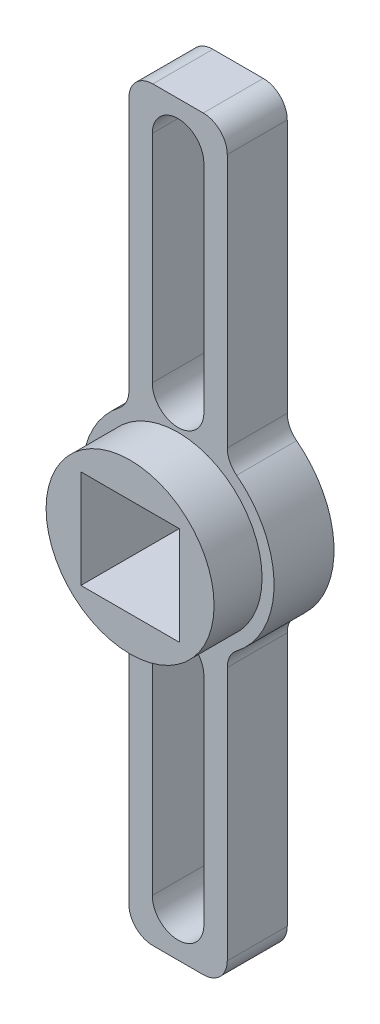
ISO-10303-21;
HEADER;
FILE_DESCRIPTION(('STEP AP214'),'2;1');
FILE_NAME('part.step','',(''),(''),'','','');
FILE_SCHEMA(('AUTOMOTIVE_DESIGN { 1 0 10303 214 1 1 1 1 }'));
ENDSEC;
DATA;
#1=APPLICATION_CONTEXT('core data for automotive mechanical design processes');
#2=APPLICATION_PROTOCOL_DEFINITION('international standard','automotive_design',2000,#1);
#3=PRODUCT_CONTEXT('',#1,'mechanical');
#4=PRODUCT('Part','Part','',(#3));
#5=PRODUCT_RELATED_PRODUCT_CATEGORY('part','',(#4));
#6=PRODUCT_DEFINITION_FORMATION('','',#4);
#7=PRODUCT_DEFINITION_CONTEXT('part definition',#1,'design');
#8=PRODUCT_DEFINITION('design','',#6,#7);
#9=PRODUCT_DEFINITION_SHAPE('','',#8);
#10=(LENGTH_UNIT() NAMED_UNIT(*) SI_UNIT(.MILLI.,.METRE.));
#11=(NAMED_UNIT(*) PLANE_ANGLE_UNIT() SI_UNIT($,.RADIAN.));
#12=(NAMED_UNIT(*) SI_UNIT($,.STERADIAN.) SOLID_ANGLE_UNIT());
#13=UNCERTAINTY_MEASURE_WITH_UNIT(LENGTH_MEASURE(1.E-05),#10,'distance_accuracy_value','');
#14=(GEOMETRIC_REPRESENTATION_CONTEXT(3) GLOBAL_UNCERTAINTY_ASSIGNED_CONTEXT((#13)) GLOBAL_UNIT_ASSIGNED_CONTEXT((#10,
#11,#12)) REPRESENTATION_CONTEXT('',''));
#15=CARTESIAN_POINT('',(0.,0.,0.));
#16=DIRECTION('',(0.,0.,1.));
#17=DIRECTION('',(1.,0.,0.));
#18=AXIS2_PLACEMENT_3D('',#15,#16,#17);
#19=CARTESIAN_POINT('',(0.,0.,5.));
#20=DIRECTION('',(0.,0.,1.));
#21=DIRECTION('',(1.,0.,0.));
#22=AXIS2_PLACEMENT_3D('',#19,#20,#21);
#23=PLANE('',#22);
#24=CARTESIAN_POINT('',(0.,27.5,5.));
#25=DIRECTION('',(0.,0.,1.));
#26=DIRECTION('',(1.,0.,0.));
#27=AXIS2_PLACEMENT_3D('',#24,#25,#26);
#28=CIRCLE('',#27,2.15);
#29=CARTESIAN_POINT('',(2.14999999999999,27.5,5.));
#30=VERTEX_POINT('',#29);
#31=CARTESIAN_POINT('',(-2.15,27.5,5.));
#32=VERTEX_POINT('',#31);
#33=EDGE_CURVE('E278',#30,#32,#28,.T.);
#34=ORIENTED_EDGE('',*,*,#33,.F.);
#35=DIRECTION('',(0.,1.,0.));
#36=VECTOR('',#35,1.);
#37=CARTESIAN_POINT('',(2.14999999999999,27.5,5.));
#38=LINE('',#37,#36);
#39=CARTESIAN_POINT('',(2.15,9.5,5.));
#40=VERTEX_POINT('',#39);
#41=EDGE_CURVE('E289',#40,#30,#38,.T.);
#42=ORIENTED_EDGE('',*,*,#41,.F.);
#43=CARTESIAN_POINT('',(0.,9.5,5.));
#44=DIRECTION('',(0.,0.,1.));
#45=DIRECTION('',(1.,0.,0.));
#46=AXIS2_PLACEMENT_3D('',#43,#44,#45);
#47=CIRCLE('',#46,2.15);
#48=CARTESIAN_POINT('',(-2.15,9.5,5.));
#49=VERTEX_POINT('',#48);
#50=EDGE_CURVE('E308',#49,#40,#47,.T.);
#51=ORIENTED_EDGE('',*,*,#50,.F.);
#52=DIRECTION('',(0.,-1.,0.));
#53=VECTOR('',#52,1.);
#54=CARTESIAN_POINT('',(-2.15,27.5,5.));
#55=LINE('',#54,#53);
#56=EDGE_CURVE('E304',#32,#49,#55,.T.);
#57=ORIENTED_EDGE('',*,*,#56,.F.);
#58=EDGE_LOOP('',(#34,#42,#51,#57));
#59=FACE_BOUND('',#58,.T.);
#60=CARTESIAN_POINT('',(0.,0.,5.));
#61=DIRECTION('',(0.,0.,1.));
#62=DIRECTION('',(1.,0.,0.));
#63=AXIS2_PLACEMENT_3D('',#60,#61,#62);
#64=CIRCLE('',#63,7.);
#65=CARTESIAN_POINT('',(7.,0.,5.));
#66=VERTEX_POINT('',#65);
#67=EDGE_CURVE('E348',#66,#66,#64,.T.);
#68=ORIENTED_EDGE('',*,*,#67,.F.);
#69=EDGE_LOOP('',(#68));
#70=FACE_BOUND('',#69,.T.);
#71=DIRECTION('',(1.,0.,0.));
#72=VECTOR('',#71,1.);
#73=CARTESIAN_POINT('',(-4.09999999999999,-31.1,5.));
#74=LINE('',#73,#72);
#75=CARTESIAN_POINT('',(-2.09999999999999,-31.1,5.));
#76=VERTEX_POINT('',#75);
#77=CARTESIAN_POINT('',(2.10000000000001,-31.1,5.));
#78=VERTEX_POINT('',#77);
#79=EDGE_CURVE('E357',#76,#78,#74,.T.);
#80=ORIENTED_EDGE('',*,*,#79,.T.);
#81=CARTESIAN_POINT('',(2.10000000000001,-29.1,5.));
#82=DIRECTION('',(0.,0.,1.));
#83=DIRECTION('',(1.,0.,0.));
#84=AXIS2_PLACEMENT_3D('',#81,#82,#83);
#85=CIRCLE('',#84,2.);
#86=CARTESIAN_POINT('',(4.10000000000001,-29.1,5.));
#87=VERTEX_POINT('',#86);
#88=EDGE_CURVE('E519',#78,#87,#85,.T.);
#89=ORIENTED_EDGE('',*,*,#88,.T.);
#90=DIRECTION('',(0.,1.,0.));
#91=VECTOR('',#90,1.);
#92=CARTESIAN_POINT('',(4.10000000000001,-31.1,5.));
#93=LINE('',#92,#91);
#94=CARTESIAN_POINT('',(4.1,-7.92401413426301,5.));
#95=VERTEX_POINT('',#94);
#96=EDGE_CURVE('E362',#87,#95,#93,.T.);
#97=ORIENTED_EDGE('',*,*,#96,.T.);
#98=CARTESIAN_POINT('',(6.1,-7.92401413426301,5.));
#99=DIRECTION('',(0.,0.,1.));
#100=DIRECTION('',(1.,0.,0.));
#101=AXIS2_PLACEMENT_3D('',#98,#99,#100);
#102=CIRCLE('',#101,2.);
#103=CARTESIAN_POINT('',(4.88,-6.33921130741041,5.));
#104=VERTEX_POINT('',#103);
#105=EDGE_CURVE('E466',#95,#104,#102,.F.);
#106=ORIENTED_EDGE('',*,*,#105,.T.);
#107=CARTESIAN_POINT('',(0.,0.,5.));
#108=DIRECTION('',(0.,0.,1.));
#109=DIRECTION('',(1.,0.,0.));
#110=AXIS2_PLACEMENT_3D('',#107,#108,#109);
#111=CIRCLE('',#110,8.);
#112=CARTESIAN_POINT('',(4.88,6.33921130741041,5.));
#113=VERTEX_POINT('',#112);
#114=EDGE_CURVE('E426',#104,#113,#111,.T.);
#115=ORIENTED_EDGE('',*,*,#114,.T.);
#116=CARTESIAN_POINT('',(6.1,7.92401413426301,5.));
#117=DIRECTION('',(0.,0.,1.));
#118=DIRECTION('',(1.,0.,0.));
#119=AXIS2_PLACEMENT_3D('',#116,#117,#118);
#120=CIRCLE('',#119,2.);
#121=CARTESIAN_POINT('',(4.1,7.92401413426301,5.));
#122=VERTEX_POINT('',#121);
#123=EDGE_CURVE('E483',#113,#122,#120,.F.);
#124=ORIENTED_EDGE('',*,*,#123,.T.);
#125=DIRECTION('',(0.,-1.,0.));
#126=VECTOR('',#125,1.);
#127=CARTESIAN_POINT('',(4.09999999999999,31.1,5.));
#128=LINE('',#127,#126);
#129=CARTESIAN_POINT('',(4.09999999999999,29.1,5.));
#130=VERTEX_POINT('',#129);
#131=EDGE_CURVE('E385',#130,#122,#128,.T.);
#132=ORIENTED_EDGE('',*,*,#131,.F.);
#133=CARTESIAN_POINT('',(2.09999999999999,29.1,5.));
#134=DIRECTION('',(0.,0.,1.));
#135=DIRECTION('',(1.,0.,0.));
#136=AXIS2_PLACEMENT_3D('',#133,#134,#135);
#137=CIRCLE('',#136,2.);
#138=CARTESIAN_POINT('',(2.09999999999999,31.1,5.));
#139=VERTEX_POINT('',#138);
#140=EDGE_CURVE('E514',#130,#139,#137,.T.);
#141=ORIENTED_EDGE('',*,*,#140,.T.);
#142=DIRECTION('',(-1.,0.,0.));
#143=VECTOR('',#142,1.);
#144=CARTESIAN_POINT('',(4.09999999999999,31.1,5.));
#145=LINE('',#144,#143);
#146=CARTESIAN_POINT('',(-2.1,31.1,5.));
#147=VERTEX_POINT('',#146);
#148=EDGE_CURVE('E377',#139,#147,#145,.T.);
#149=ORIENTED_EDGE('',*,*,#148,.T.);
#150=CARTESIAN_POINT('',(-2.1,29.1,5.));
#151=DIRECTION('',(0.,0.,1.));
#152=DIRECTION('',(1.,0.,0.));
#153=AXIS2_PLACEMENT_3D('',#150,#151,#152);
#154=CIRCLE('',#153,2.);
#155=CARTESIAN_POINT('',(-4.1,29.1,5.));
#156=VERTEX_POINT('',#155);
#157=EDGE_CURVE('E65',#147,#156,#154,.T.);
#158=ORIENTED_EDGE('',*,*,#157,.T.);
#159=DIRECTION('',(0.,-1.,0.));
#160=VECTOR('',#159,1.);
#161=CARTESIAN_POINT('',(-4.1,31.1,5.));
#162=LINE('',#161,#160);
#163=CARTESIAN_POINT('',(-4.1,7.92401413426301,5.));
#164=VERTEX_POINT('',#163);
#165=EDGE_CURVE('E381',#156,#164,#162,.T.);
#166=ORIENTED_EDGE('',*,*,#165,.T.);
#167=CARTESIAN_POINT('',(-6.1,7.92401413426301,5.));
#168=DIRECTION('',(0.,0.,1.));
#169=DIRECTION('',(1.,0.,0.));
#170=AXIS2_PLACEMENT_3D('',#167,#168,#169);
#171=CIRCLE('',#170,2.);
#172=CARTESIAN_POINT('',(-4.88,6.33921130741041,5.));
#173=VERTEX_POINT('',#172);
#174=EDGE_CURVE('E480',#164,#173,#171,.F.);
#175=ORIENTED_EDGE('',*,*,#174,.T.);
#176=CARTESIAN_POINT('',(-4.88,-6.33921130741041,5.));
#177=VERTEX_POINT('',#176);
#178=EDGE_CURVE('E353',#173,#177,#111,.T.);
#179=ORIENTED_EDGE('',*,*,#178,.T.);
#180=CARTESIAN_POINT('',(-6.1,-7.92401413426301,5.));
#181=DIRECTION('',(0.,0.,1.));
#182=DIRECTION('',(1.,0.,0.));
#183=AXIS2_PLACEMENT_3D('',#180,#181,#182);
#184=CIRCLE('',#183,2.);
#185=CARTESIAN_POINT('',(-4.1,-7.92401413426301,5.));
#186=VERTEX_POINT('',#185);
#187=EDGE_CURVE('E469',#177,#186,#184,.F.);
#188=ORIENTED_EDGE('',*,*,#187,.T.);
#189=DIRECTION('',(0.,1.,0.));
#190=VECTOR('',#189,1.);
#191=CARTESIAN_POINT('',(-4.09999999999999,-31.1,5.));
#192=LINE('',#191,#190);
#193=CARTESIAN_POINT('',(-4.09999999999999,-29.1,5.));
#194=VERTEX_POINT('',#193);
#195=EDGE_CURVE('E366',#194,#186,#192,.T.);
#196=ORIENTED_EDGE('',*,*,#195,.F.);
#197=CARTESIAN_POINT('',(-2.09999999999999,-29.1,5.));
#198=DIRECTION('',(0.,0.,1.));
#199=DIRECTION('',(1.,0.,0.));
#200=AXIS2_PLACEMENT_3D('',#197,#198,#199);
#201=CIRCLE('',#200,2.);
#202=EDGE_CURVE('E57',#194,#76,#201,.T.);
#203=ORIENTED_EDGE('',*,*,#202,.T.);
#204=EDGE_LOOP('',(#80,#89,#97,#106,#115,#124,#132,#141,#149,#158,#166,#175,#179,#188,#196,#203));
#205=FACE_BOUND('',#204,.T.);
#206=DIRECTION('',(0.,-1.,0.));
#207=VECTOR('',#206,1.);
#208=CARTESIAN_POINT('',(2.14999999999999,-27.5,5.));
#209=LINE('',#208,#207);
#210=CARTESIAN_POINT('',(2.15,-9.5,5.));
#211=VERTEX_POINT('',#210);
#212=CARTESIAN_POINT('',(2.14999999999999,-27.5,5.));
#213=VERTEX_POINT('',#212);
#214=EDGE_CURVE('E269',#211,#213,#209,.T.);
#215=ORIENTED_EDGE('',*,*,#214,.T.);
#216=CARTESIAN_POINT('',(0.,-27.5,5.));
#217=DIRECTION('',(0.,0.,-1.));
#218=DIRECTION('',(1.,0.,0.));
#219=AXIS2_PLACEMENT_3D('',#216,#217,#218);
#220=CIRCLE('',#219,2.15);
#221=CARTESIAN_POINT('',(-2.15,-27.5,5.));
#222=VERTEX_POINT('',#221);
#223=EDGE_CURVE('E249',#213,#222,#220,.T.);
#224=ORIENTED_EDGE('',*,*,#223,.T.);
#225=DIRECTION('',(0.,1.,0.));
#226=VECTOR('',#225,1.);
#227=CARTESIAN_POINT('',(-2.15,-27.5,5.));
#228=LINE('',#227,#226);
#229=CARTESIAN_POINT('',(-2.15,-9.5,5.));
#230=VERTEX_POINT('',#229);
#231=EDGE_CURVE('E256',#222,#230,#228,.T.);
#232=ORIENTED_EDGE('',*,*,#231,.T.);
#233=CARTESIAN_POINT('',(0.,-9.5,5.));
#234=DIRECTION('',(0.,0.,-1.));
#235=DIRECTION('',(1.,0.,0.));
#236=AXIS2_PLACEMENT_3D('',#233,#234,#235);
#237=CIRCLE('',#236,2.15);
#238=EDGE_CURVE('E260',#230,#211,#237,.T.);
#239=ORIENTED_EDGE('',*,*,#238,.T.);
#240=EDGE_LOOP('',(#215,#224,#232,#239));
#241=FACE_BOUND('',#240,.T.);
#242=ADVANCED_FACE('F41',(#59,#70,#205,#241),#23,.T.);
#243=CARTESIAN_POINT('',(0.,0.,0.));
#244=DIRECTION('',(0.,0.,1.));
#245=DIRECTION('',(1.,0.,0.));
#246=AXIS2_PLACEMENT_3D('',#243,#244,#245);
#247=PLANE('',#246);
#248=DIRECTION('',(0.,1.,0.));
#249=VECTOR('',#248,1.);
#250=CARTESIAN_POINT('',(4.10000000000001,-31.1,0.));
#251=LINE('',#250,#249);
#252=CARTESIAN_POINT('',(4.10000000000001,-29.1,0.));
#253=VERTEX_POINT('',#252);
#254=CARTESIAN_POINT('',(4.1,-7.92401413426301,0.));
#255=VERTEX_POINT('',#254);
#256=EDGE_CURVE('E361',#253,#255,#251,.T.);
#257=ORIENTED_EDGE('',*,*,#256,.F.);
#258=CARTESIAN_POINT('',(2.10000000000001,-29.1,0.));
#259=DIRECTION('',(0.,0.,1.));
#260=DIRECTION('',(1.,0.,0.));
#261=AXIS2_PLACEMENT_3D('',#258,#259,#260);
#262=CIRCLE('',#261,2.);
#263=CARTESIAN_POINT('',(2.10000000000001,-31.1,0.));
#264=VERTEX_POINT('',#263);
#265=EDGE_CURVE('E503',#253,#264,#262,.F.);
#266=ORIENTED_EDGE('',*,*,#265,.T.);
#267=DIRECTION('',(-1.,0.,0.));
#268=VECTOR('',#267,1.);
#269=CARTESIAN_POINT('',(4.10000000000001,-31.1,0.));
#270=LINE('',#269,#268);
#271=CARTESIAN_POINT('',(-2.09999999999999,-31.1,0.));
#272=VERTEX_POINT('',#271);
#273=EDGE_CURVE('E347',#264,#272,#270,.T.);
#274=ORIENTED_EDGE('',*,*,#273,.T.);
#275=CARTESIAN_POINT('',(-2.09999999999999,-29.1,0.));
#276=DIRECTION('',(0.,0.,1.));
#277=DIRECTION('',(1.,0.,0.));
#278=AXIS2_PLACEMENT_3D('',#275,#276,#277);
#279=CIRCLE('',#278,2.);
#280=CARTESIAN_POINT('',(-4.09999999999999,-29.1,0.));
#281=VERTEX_POINT('',#280);
#282=EDGE_CURVE('E500',#272,#281,#279,.F.);
#283=ORIENTED_EDGE('',*,*,#282,.T.);
#284=DIRECTION('',(0.,1.,0.));
#285=VECTOR('',#284,1.);
#286=CARTESIAN_POINT('',(-4.09999999999999,-31.1,0.));
#287=LINE('',#286,#285);
#288=CARTESIAN_POINT('',(-4.1,-7.92401413426301,0.));
#289=VERTEX_POINT('',#288);
#290=EDGE_CURVE('E369',#281,#289,#287,.T.);
#291=ORIENTED_EDGE('',*,*,#290,.T.);
#292=CARTESIAN_POINT('',(-6.1,-7.92401413426301,0.));
#293=DIRECTION('',(0.,0.,1.));
#294=DIRECTION('',(1.,0.,0.));
#295=AXIS2_PLACEMENT_3D('',#292,#293,#294);
#296=CIRCLE('',#295,2.);
#297=CARTESIAN_POINT('',(-4.88,-6.33921130741041,0.));
#298=VERTEX_POINT('',#297);
#299=EDGE_CURVE('E473',#289,#298,#296,.T.);
#300=ORIENTED_EDGE('',*,*,#299,.T.);
#301=CARTESIAN_POINT('',(0.,0.,0.));
#302=DIRECTION('',(0.,0.,1.));
#303=DIRECTION('',(1.,0.,0.));
#304=AXIS2_PLACEMENT_3D('',#301,#302,#303);
#305=CIRCLE('',#304,8.);
#306=CARTESIAN_POINT('',(-4.88,6.33921130741041,0.));
#307=VERTEX_POINT('',#306);
#308=EDGE_CURVE('E427',#307,#298,#305,.T.);
#309=ORIENTED_EDGE('',*,*,#308,.F.);
#310=CARTESIAN_POINT('',(-6.1,7.92401413426301,0.));
#311=DIRECTION('',(0.,0.,1.));
#312=DIRECTION('',(1.,0.,0.));
#313=AXIS2_PLACEMENT_3D('',#310,#311,#312);
#314=CIRCLE('',#313,2.);
#315=CARTESIAN_POINT('',(-4.1,7.92401413426301,0.));
#316=VERTEX_POINT('',#315);
#317=EDGE_CURVE('E476',#307,#316,#314,.T.);
#318=ORIENTED_EDGE('',*,*,#317,.T.);
#319=DIRECTION('',(0.,-1.,0.));
#320=VECTOR('',#319,1.);
#321=CARTESIAN_POINT('',(-4.1,31.1,0.));
#322=LINE('',#321,#320);
#323=CARTESIAN_POINT('',(-4.1,29.1,0.));
#324=VERTEX_POINT('',#323);
#325=EDGE_CURVE('E380',#324,#316,#322,.T.);
#326=ORIENTED_EDGE('',*,*,#325,.F.);
#327=CARTESIAN_POINT('',(-2.1,29.1,0.));
#328=DIRECTION('',(0.,0.,1.));
#329=DIRECTION('',(1.,0.,0.));
#330=AXIS2_PLACEMENT_3D('',#327,#328,#329);
#331=CIRCLE('',#330,2.);
#332=CARTESIAN_POINT('',(-2.1,31.1,0.));
#333=VERTEX_POINT('',#332);
#334=EDGE_CURVE('E494',#324,#333,#331,.F.);
#335=ORIENTED_EDGE('',*,*,#334,.T.);
#336=DIRECTION('',(1.,0.,0.));
#337=VECTOR('',#336,1.);
#338=CARTESIAN_POINT('',(-4.1,31.1,0.));
#339=LINE('',#338,#337);
#340=CARTESIAN_POINT('',(2.09999999999999,31.1,0.));
#341=VERTEX_POINT('',#340);
#342=EDGE_CURVE('E365',#333,#341,#339,.T.);
#343=ORIENTED_EDGE('',*,*,#342,.T.);
#344=CARTESIAN_POINT('',(2.09999999999999,29.1,0.));
#345=DIRECTION('',(0.,0.,1.));
#346=DIRECTION('',(1.,0.,0.));
#347=AXIS2_PLACEMENT_3D('',#344,#345,#346);
#348=CIRCLE('',#347,2.);
#349=CARTESIAN_POINT('',(4.09999999999999,29.1,0.));
#350=VERTEX_POINT('',#349);
#351=EDGE_CURVE('E497',#341,#350,#348,.F.);
#352=ORIENTED_EDGE('',*,*,#351,.T.);
#353=DIRECTION('',(0.,-1.,0.));
#354=VECTOR('',#353,1.);
#355=CARTESIAN_POINT('',(4.09999999999999,31.1,0.));
#356=LINE('',#355,#354);
#357=CARTESIAN_POINT('',(4.1,7.92401413426301,0.));
#358=VERTEX_POINT('',#357);
#359=EDGE_CURVE('E388',#350,#358,#356,.T.);
#360=ORIENTED_EDGE('',*,*,#359,.T.);
#361=CARTESIAN_POINT('',(6.1,7.92401413426301,0.));
#362=DIRECTION('',(0.,0.,1.));
#363=DIRECTION('',(1.,0.,0.));
#364=AXIS2_PLACEMENT_3D('',#361,#362,#363);
#365=CIRCLE('',#364,2.);
#366=CARTESIAN_POINT('',(4.88,6.33921130741041,0.));
#367=VERTEX_POINT('',#366);
#368=EDGE_CURVE('E487',#358,#367,#365,.T.);
#369=ORIENTED_EDGE('',*,*,#368,.T.);
#370=CARTESIAN_POINT('',(4.88,-6.33921130741041,0.));
#371=VERTEX_POINT('',#370);
#372=EDGE_CURVE('E422',#371,#367,#305,.T.);
#373=ORIENTED_EDGE('',*,*,#372,.F.);
#374=CARTESIAN_POINT('',(6.1,-7.92401413426301,0.));
#375=DIRECTION('',(0.,0.,1.));
#376=DIRECTION('',(1.,0.,0.));
#377=AXIS2_PLACEMENT_3D('',#374,#375,#376);
#378=CIRCLE('',#377,2.);
#379=EDGE_CURVE('E462',#371,#255,#378,.T.);
#380=ORIENTED_EDGE('',*,*,#379,.T.);
#381=EDGE_LOOP('',(#257,#266,#274,#283,#291,#300,#309,#318,#326,#335,#343,#352,#360,#369,#373,#380));
#382=FACE_BOUND('',#381,.T.);
#383=DIRECTION('',(1.,0.,0.));
#384=VECTOR('',#383,1.);
#385=CARTESIAN_POINT('',(4.1,-4.1,0.));
#386=LINE('',#385,#384);
#387=CARTESIAN_POINT('',(-4.1,-4.1,0.));
#388=VERTEX_POINT('',#387);
#389=CARTESIAN_POINT('',(4.1,-4.1,0.));
#390=VERTEX_POINT('',#389);
#391=EDGE_CURVE('E396',#388,#390,#386,.T.);
#392=ORIENTED_EDGE('',*,*,#391,.T.);
#393=DIRECTION('',(0.,1.,0.));
#394=VECTOR('',#393,1.);
#395=CARTESIAN_POINT('',(4.1,-4.1,0.));
#396=LINE('',#395,#394);
#397=CARTESIAN_POINT('',(4.1,4.1,0.));
#398=VERTEX_POINT('',#397);
#399=EDGE_CURVE('E400',#390,#398,#396,.T.);
#400=ORIENTED_EDGE('',*,*,#399,.T.);
#401=DIRECTION('',(-1.,0.,0.));
#402=VECTOR('',#401,1.);
#403=CARTESIAN_POINT('',(4.1,4.1,0.));
#404=LINE('',#403,#402);
#405=CARTESIAN_POINT('',(-4.1,4.1,0.));
#406=VERTEX_POINT('',#405);
#407=EDGE_CURVE('E404',#398,#406,#404,.T.);
#408=ORIENTED_EDGE('',*,*,#407,.T.);
#409=DIRECTION('',(0.,-1.,0.));
#410=VECTOR('',#409,1.);
#411=CARTESIAN_POINT('',(-4.1,-4.1,0.));
#412=LINE('',#411,#410);
#413=EDGE_CURVE('E384',#406,#388,#412,.T.);
#414=ORIENTED_EDGE('',*,*,#413,.T.);
#415=EDGE_LOOP('',(#392,#400,#408,#414));
#416=FACE_BOUND('',#415,.T.);
#417=DIRECTION('',(0.,1.,0.));
#418=VECTOR('',#417,1.);
#419=CARTESIAN_POINT('',(2.14999999999999,27.5,0.));
#420=LINE('',#419,#418);
#421=CARTESIAN_POINT('',(2.15,9.5,0.));
#422=VERTEX_POINT('',#421);
#423=CARTESIAN_POINT('',(2.14999999999999,27.5,0.));
#424=VERTEX_POINT('',#423);
#425=EDGE_CURVE('E297',#422,#424,#420,.T.);
#426=ORIENTED_EDGE('',*,*,#425,.T.);
#427=CARTESIAN_POINT('',(0.,27.5,0.));
#428=DIRECTION('',(0.,0.,1.));
#429=DIRECTION('',(1.,0.,0.));
#430=AXIS2_PLACEMENT_3D('',#427,#428,#429);
#431=CIRCLE('',#430,2.15);
#432=CARTESIAN_POINT('',(-2.15,27.5,0.));
#433=VERTEX_POINT('',#432);
#434=EDGE_CURVE('E284',#424,#433,#431,.T.);
#435=ORIENTED_EDGE('',*,*,#434,.T.);
#436=DIRECTION('',(0.,-1.,0.));
#437=VECTOR('',#436,1.);
#438=CARTESIAN_POINT('',(-2.15,27.5,0.));
#439=LINE('',#438,#437);
#440=CARTESIAN_POINT('',(-2.15,9.5,0.));
#441=VERTEX_POINT('',#440);
#442=EDGE_CURVE('E288',#433,#441,#439,.T.);
#443=ORIENTED_EDGE('',*,*,#442,.T.);
#444=CARTESIAN_POINT('',(0.,9.5,0.));
#445=DIRECTION('',(0.,0.,1.));
#446=DIRECTION('',(1.,0.,0.));
#447=AXIS2_PLACEMENT_3D('',#444,#445,#446);
#448=CIRCLE('',#447,2.15);
#449=EDGE_CURVE('E293',#441,#422,#448,.T.);
#450=ORIENTED_EDGE('',*,*,#449,.T.);
#451=EDGE_LOOP('',(#426,#435,#443,#450));
#452=FACE_BOUND('',#451,.T.);
#453=CARTESIAN_POINT('',(0.,-27.5,0.));
#454=DIRECTION('',(0.,0.,-1.));
#455=DIRECTION('',(1.,0.,0.));
#456=AXIS2_PLACEMENT_3D('',#453,#454,#455);
#457=CIRCLE('',#456,2.15);
#458=CARTESIAN_POINT('',(2.14999999999999,-27.5,0.));
#459=VERTEX_POINT('',#458);
#460=CARTESIAN_POINT('',(-2.15,-27.5,0.));
#461=VERTEX_POINT('',#460);
#462=EDGE_CURVE('E242',#459,#461,#457,.T.);
#463=ORIENTED_EDGE('',*,*,#462,.F.);
#464=DIRECTION('',(0.,-1.,0.));
#465=VECTOR('',#464,1.);
#466=CARTESIAN_POINT('',(2.14999999999999,-27.5,0.));
#467=LINE('',#466,#465);
#468=CARTESIAN_POINT('',(2.15,-9.5,0.));
#469=VERTEX_POINT('',#468);
#470=EDGE_CURVE('E229',#469,#459,#467,.T.);
#471=ORIENTED_EDGE('',*,*,#470,.F.);
#472=CARTESIAN_POINT('',(0.,-9.5,0.));
#473=DIRECTION('',(0.,0.,-1.));
#474=DIRECTION('',(1.,0.,0.));
#475=AXIS2_PLACEMENT_3D('',#472,#473,#474);
#476=CIRCLE('',#475,2.15);
#477=CARTESIAN_POINT('',(-2.15,-9.5,0.));
#478=VERTEX_POINT('',#477);
#479=EDGE_CURVE('E241',#478,#469,#476,.T.);
#480=ORIENTED_EDGE('',*,*,#479,.F.);
#481=DIRECTION('',(0.,1.,0.));
#482=VECTOR('',#481,1.);
#483=CARTESIAN_POINT('',(-2.15,-27.5,0.));
#484=LINE('',#483,#482);
#485=EDGE_CURVE('E251',#461,#478,#484,.T.);
#486=ORIENTED_EDGE('',*,*,#485,.F.);
#487=EDGE_LOOP('',(#463,#471,#480,#486));
#488=FACE_BOUND('',#487,.T.);
#489=ADVANCED_FACE('F254',(#382,#416,#452,#488),#247,.F.);
#490=CARTESIAN_POINT('',(0.,0.,5.));
#491=DIRECTION('',(0.,0.,-1.));
#492=DIRECTION('',(-1.,0.,0.));
#493=AXIS2_PLACEMENT_3D('',#490,#491,#492);
#494=CYLINDRICAL_SURFACE('',#493,8.);
#495=ORIENTED_EDGE('',*,*,#114,.F.);
#496=DIRECTION('',(0.,0.,-1.));
#497=VECTOR('',#496,1.);
#498=CARTESIAN_POINT('',(4.88,-6.33921130741041,5.));
#499=LINE('',#498,#497);
#500=EDGE_CURVE('E434',#104,#371,#499,.T.);
#501=ORIENTED_EDGE('',*,*,#500,.T.);
#502=ORIENTED_EDGE('',*,*,#372,.T.);
#503=DIRECTION('',(0.,0.,-1.));
#504=VECTOR('',#503,1.);
#505=CARTESIAN_POINT('',(4.88,6.33921130741041,5.));
#506=LINE('',#505,#504);
#507=EDGE_CURVE('E352',#367,#113,#506,.F.);
#508=ORIENTED_EDGE('',*,*,#507,.T.);
#509=EDGE_LOOP('',(#495,#501,#502,#508));
#510=FACE_BOUND('',#509,.T.);
#511=ADVANCED_FACE('F561',(#510),#494,.T.);
#512=ORIENTED_EDGE('',*,*,#308,.T.);
#513=DIRECTION('',(0.,0.,-1.));
#514=VECTOR('',#513,1.);
#515=CARTESIAN_POINT('',(-4.88,-6.33921130741041,5.));
#516=LINE('',#515,#514);
#517=EDGE_CURVE('E446',#298,#177,#516,.F.);
#518=ORIENTED_EDGE('',*,*,#517,.T.);
#519=ORIENTED_EDGE('',*,*,#178,.F.);
#520=DIRECTION('',(0.,0.,-1.));
#521=VECTOR('',#520,1.);
#522=CARTESIAN_POINT('',(-4.88,6.33921130741041,5.));
#523=LINE('',#522,#521);
#524=EDGE_CURVE('E442',#173,#307,#523,.T.);
#525=ORIENTED_EDGE('',*,*,#524,.T.);
#526=EDGE_LOOP('',(#512,#518,#519,#525));
#527=FACE_BOUND('',#526,.T.);
#528=ADVANCED_FACE('F593',(#527),#494,.T.);
#529=CARTESIAN_POINT('',(-4.1,-4.1,5.));
#530=DIRECTION('',(1.,0.,0.));
#531=DIRECTION('',(0.,0.,-1.));
#532=AXIS2_PLACEMENT_3D('',#529,#530,#531);
#533=PLANE('',#532);
#534=ORIENTED_EDGE('',*,*,#413,.F.);
#535=DIRECTION('',(0.,0.,-1.));
#536=VECTOR('',#535,1.);
#537=CARTESIAN_POINT('',(-4.1,4.1,5.));
#538=LINE('',#537,#536);
#539=CARTESIAN_POINT('',(-4.1,4.1,9.));
#540=VERTEX_POINT('',#539);
#541=EDGE_CURVE('E408',#540,#406,#538,.T.);
#542=ORIENTED_EDGE('',*,*,#541,.F.);
#543=DIRECTION('',(0.,-1.,0.));
#544=VECTOR('',#543,1.);
#545=CARTESIAN_POINT('',(-4.1,4.1,9.));
#546=LINE('',#545,#544);
#547=CARTESIAN_POINT('',(-4.1,-4.1,9.));
#548=VERTEX_POINT('',#547);
#549=EDGE_CURVE('E335',#540,#548,#546,.T.);
#550=ORIENTED_EDGE('',*,*,#549,.T.);
#551=DIRECTION('',(0.,0.,-1.));
#552=VECTOR('',#551,1.);
#553=CARTESIAN_POINT('',(-4.1,-4.1,5.));
#554=LINE('',#553,#552);
#555=EDGE_CURVE('E418',#548,#388,#554,.T.);
#556=ORIENTED_EDGE('',*,*,#555,.T.);
#557=EDGE_LOOP('',(#534,#542,#550,#556));
#558=FACE_BOUND('',#557,.T.);
#559=ADVANCED_FACE('F617',(#558),#533,.T.);
#560=CARTESIAN_POINT('',(4.1,-4.1,5.));
#561=DIRECTION('',(0.,1.,0.));
#562=DIRECTION('',(-1.,0.,0.));
#563=AXIS2_PLACEMENT_3D('',#560,#561,#562);
#564=PLANE('',#563);
#565=ORIENTED_EDGE('',*,*,#391,.F.);
#566=ORIENTED_EDGE('',*,*,#555,.F.);
#567=DIRECTION('',(1.,0.,0.));
#568=VECTOR('',#567,1.);
#569=CARTESIAN_POINT('',(-4.1,-4.1,9.));
#570=LINE('',#569,#568);
#571=CARTESIAN_POINT('',(4.1,-4.1,9.));
#572=VERTEX_POINT('',#571);
#573=EDGE_CURVE('E339',#548,#572,#570,.T.);
#574=ORIENTED_EDGE('',*,*,#573,.T.);
#575=DIRECTION('',(0.,0.,-1.));
#576=VECTOR('',#575,1.);
#577=CARTESIAN_POINT('',(4.1,-4.1,5.));
#578=LINE('',#577,#576);
#579=EDGE_CURVE('E415',#572,#390,#578,.T.);
#580=ORIENTED_EDGE('',*,*,#579,.T.);
#581=EDGE_LOOP('',(#565,#566,#574,#580));
#582=FACE_BOUND('',#581,.T.);
#583=ADVANCED_FACE('F625',(#582),#564,.T.);
#584=CARTESIAN_POINT('',(4.1,-4.1,5.));
#585=DIRECTION('',(-1.,0.,0.));
#586=DIRECTION('',(0.,0.,1.));
#587=AXIS2_PLACEMENT_3D('',#584,#585,#586);
#588=PLANE('',#587);
#589=ORIENTED_EDGE('',*,*,#399,.F.);
#590=ORIENTED_EDGE('',*,*,#579,.F.);
#591=DIRECTION('',(0.,1.,0.));
#592=VECTOR('',#591,1.);
#593=CARTESIAN_POINT('',(4.1,-4.1,9.));
#594=LINE('',#593,#592);
#595=CARTESIAN_POINT('',(4.1,4.1,9.));
#596=VERTEX_POINT('',#595);
#597=EDGE_CURVE('E318',#572,#596,#594,.T.);
#598=ORIENTED_EDGE('',*,*,#597,.T.);
#599=DIRECTION('',(0.,0.,-1.));
#600=VECTOR('',#599,1.);
#601=CARTESIAN_POINT('',(4.1,4.1,5.));
#602=LINE('',#601,#600);
#603=EDGE_CURVE('E412',#596,#398,#602,.T.);
#604=ORIENTED_EDGE('',*,*,#603,.T.);
#605=EDGE_LOOP('',(#589,#590,#598,#604));
#606=FACE_BOUND('',#605,.T.);
#607=ADVANCED_FACE('F772',(#606),#588,.T.);
#608=CARTESIAN_POINT('',(4.1,4.1,5.));
#609=DIRECTION('',(0.,-1.,0.));
#610=DIRECTION('',(1.,0.,0.));
#611=AXIS2_PLACEMENT_3D('',#608,#609,#610);
#612=PLANE('',#611);
#613=ORIENTED_EDGE('',*,*,#407,.F.);
#614=ORIENTED_EDGE('',*,*,#603,.F.);
#615=DIRECTION('',(-1.,0.,0.));
#616=VECTOR('',#615,1.);
#617=CARTESIAN_POINT('',(4.1,4.1,9.));
#618=LINE('',#617,#616);
#619=EDGE_CURVE('E331',#596,#540,#618,.T.);
#620=ORIENTED_EDGE('',*,*,#619,.T.);
#621=ORIENTED_EDGE('',*,*,#541,.T.);
#622=EDGE_LOOP('',(#613,#614,#620,#621));
#623=FACE_BOUND('',#622,.T.);
#624=ADVANCED_FACE('F649',(#623),#612,.T.);
#625=CARTESIAN_POINT('',(-4.1,31.1,5.));
#626=DIRECTION('',(-1.,0.,0.));
#627=DIRECTION('',(0.,-1.,0.));
#628=AXIS2_PLACEMENT_3D('',#625,#626,#627);
#629=PLANE('',#628);
#630=ORIENTED_EDGE('',*,*,#165,.F.);
#631=DIRECTION('',(0.,0.,-1.));
#632=VECTOR('',#631,1.);
#633=CARTESIAN_POINT('',(-4.1,29.1,0.));
#634=LINE('',#633,#632);
#635=EDGE_CURVE('E11',#156,#324,#634,.T.);
#636=ORIENTED_EDGE('',*,*,#635,.T.);
#637=ORIENTED_EDGE('',*,*,#325,.T.);
#638=DIRECTION('',(0.,0.,-1.));
#639=VECTOR('',#638,1.);
#640=CARTESIAN_POINT('',(-4.1,7.92401413426301,5.));
#641=LINE('',#640,#639);
#642=EDGE_CURVE('E454',#316,#164,#641,.F.);
#643=ORIENTED_EDGE('',*,*,#642,.T.);
#644=EDGE_LOOP('',(#630,#636,#637,#643));
#645=FACE_BOUND('',#644,.T.);
#646=ADVANCED_FACE('F644',(#645),#629,.T.);
#647=CARTESIAN_POINT('',(4.09999999999999,31.1,0.));
#648=DIRECTION('',(1.,0.,0.));
#649=DIRECTION('',(0.,1.,0.));
#650=AXIS2_PLACEMENT_3D('',#647,#648,#649);
#651=PLANE('',#650);
#652=ORIENTED_EDGE('',*,*,#359,.F.);
#653=DIRECTION('',(0.,0.,1.));
#654=VECTOR('',#653,1.);
#655=CARTESIAN_POINT('',(4.09999999999999,29.1,5.));
#656=LINE('',#655,#654);
#657=EDGE_CURVE('E525',#350,#130,#656,.T.);
#658=ORIENTED_EDGE('',*,*,#657,.T.);
#659=ORIENTED_EDGE('',*,*,#131,.T.);
#660=DIRECTION('',(0.,0.,-1.));
#661=VECTOR('',#660,1.);
#662=CARTESIAN_POINT('',(4.1,7.92401413426301,0.));
#663=LINE('',#662,#661);
#664=EDGE_CURVE('E458',#122,#358,#663,.T.);
#665=ORIENTED_EDGE('',*,*,#664,.T.);
#666=EDGE_LOOP('',(#652,#658,#659,#665));
#667=FACE_BOUND('',#666,.T.);
#668=ADVANCED_FACE('F549',(#667),#651,.T.);
#669=CARTESIAN_POINT('',(0.,31.1,0.));
#670=DIRECTION('',(0.,-1.,0.));
#671=DIRECTION('',(1.,0.,0.));
#672=AXIS2_PLACEMENT_3D('',#669,#670,#671);
#673=PLANE('',#672);
#674=ORIENTED_EDGE('',*,*,#148,.F.);
#675=DIRECTION('',(0.,0.,1.));
#676=VECTOR('',#675,1.);
#677=CARTESIAN_POINT('',(2.09999999999999,31.1,0.));
#678=LINE('',#677,#676);
#679=EDGE_CURVE('E50',#139,#341,#678,.F.);
#680=ORIENTED_EDGE('',*,*,#679,.T.);
#681=ORIENTED_EDGE('',*,*,#342,.F.);
#682=DIRECTION('',(0.,0.,-1.));
#683=VECTOR('',#682,1.);
#684=CARTESIAN_POINT('',(-2.1,31.1,5.));
#685=LINE('',#684,#683);
#686=EDGE_CURVE('E529',#333,#147,#685,.F.);
#687=ORIENTED_EDGE('',*,*,#686,.T.);
#688=EDGE_LOOP('',(#674,#680,#681,#687));
#689=FACE_BOUND('',#688,.T.);
#690=ADVANCED_FACE('F536',(#689),#673,.F.);
#691=CARTESIAN_POINT('',(4.10000000000001,-31.1,5.));
#692=DIRECTION('',(1.,0.,0.));
#693=DIRECTION('',(0.,1.,0.));
#694=AXIS2_PLACEMENT_3D('',#691,#692,#693);
#695=PLANE('',#694);
#696=ORIENTED_EDGE('',*,*,#96,.F.);
#697=DIRECTION('',(0.,0.,-1.));
#698=VECTOR('',#697,1.);
#699=CARTESIAN_POINT('',(4.10000000000001,-29.1,0.));
#700=LINE('',#699,#698);
#701=EDGE_CURVE('E490',#87,#253,#700,.T.);
#702=ORIENTED_EDGE('',*,*,#701,.T.);
#703=ORIENTED_EDGE('',*,*,#256,.T.);
#704=DIRECTION('',(0.,0.,-1.));
#705=VECTOR('',#704,1.);
#706=CARTESIAN_POINT('',(4.1,-7.92401413426301,5.));
#707=LINE('',#706,#705);
#708=EDGE_CURVE('E438',#255,#95,#707,.F.);
#709=ORIENTED_EDGE('',*,*,#708,.T.);
#710=EDGE_LOOP('',(#696,#702,#703,#709));
#711=FACE_BOUND('',#710,.T.);
#712=ADVANCED_FACE('F572',(#711),#695,.T.);
#713=CARTESIAN_POINT('',(-4.09999999999999,-31.1,0.));
#714=DIRECTION('',(-1.,0.,0.));
#715=DIRECTION('',(0.,-1.,0.));
#716=AXIS2_PLACEMENT_3D('',#713,#714,#715);
#717=PLANE('',#716);
#718=ORIENTED_EDGE('',*,*,#290,.F.);
#719=DIRECTION('',(0.,0.,1.));
#720=VECTOR('',#719,1.);
#721=CARTESIAN_POINT('',(-4.09999999999999,-29.1,5.));
#722=LINE('',#721,#720);
#723=EDGE_CURVE('E522',#281,#194,#722,.T.);
#724=ORIENTED_EDGE('',*,*,#723,.T.);
#725=ORIENTED_EDGE('',*,*,#195,.T.);
#726=DIRECTION('',(0.,0.,-1.));
#727=VECTOR('',#726,1.);
#728=CARTESIAN_POINT('',(-4.1,-7.92401413426301,0.));
#729=LINE('',#728,#727);
#730=EDGE_CURVE('E450',#186,#289,#729,.T.);
#731=ORIENTED_EDGE('',*,*,#730,.T.);
#732=EDGE_LOOP('',(#718,#724,#725,#731));
#733=FACE_BOUND('',#732,.T.);
#734=ADVANCED_FACE('F585',(#733),#717,.T.);
#735=CARTESIAN_POINT('',(0.,-31.1,0.));
#736=DIRECTION('',(0.,1.,0.));
#737=DIRECTION('',(-1.,0.,0.));
#738=AXIS2_PLACEMENT_3D('',#735,#736,#737);
#739=PLANE('',#738);
#740=ORIENTED_EDGE('',*,*,#273,.F.);
#741=DIRECTION('',(0.,0.,-1.));
#742=VECTOR('',#741,1.);
#743=CARTESIAN_POINT('',(2.10000000000001,-31.1,5.));
#744=LINE('',#743,#742);
#745=EDGE_CURVE('E509',#264,#78,#744,.F.);
#746=ORIENTED_EDGE('',*,*,#745,.T.);
#747=ORIENTED_EDGE('',*,*,#79,.F.);
#748=DIRECTION('',(0.,0.,1.));
#749=VECTOR('',#748,1.);
#750=CARTESIAN_POINT('',(-2.09999999999999,-31.1,0.));
#751=LINE('',#750,#749);
#752=EDGE_CURVE('E506',#76,#272,#751,.F.);
#753=ORIENTED_EDGE('',*,*,#752,.T.);
#754=EDGE_LOOP('',(#740,#746,#747,#753));
#755=FACE_BOUND('',#754,.T.);
#756=ADVANCED_FACE('F580',(#755),#739,.F.);
#757=CARTESIAN_POINT('',(0.,0.,9.));
#758=DIRECTION('',(0.,0.,1.));
#759=DIRECTION('',(1.,0.,0.));
#760=AXIS2_PLACEMENT_3D('',#757,#758,#759);
#761=PLANE('',#760);
#762=CARTESIAN_POINT('',(0.,0.,9.));
#763=DIRECTION('',(0.,0.,1.));
#764=DIRECTION('',(1.,0.,0.));
#765=AXIS2_PLACEMENT_3D('',#762,#763,#764);
#766=CIRCLE('',#765,7.);
#767=CARTESIAN_POINT('',(7.,0.,9.));
#768=VERTEX_POINT('',#767);
#769=EDGE_CURVE('E343',#768,#768,#766,.T.);
#770=ORIENTED_EDGE('',*,*,#769,.T.);
#771=EDGE_LOOP('',(#770));
#772=FACE_BOUND('',#771,.T.);
#773=ORIENTED_EDGE('',*,*,#619,.F.);
#774=ORIENTED_EDGE('',*,*,#597,.F.);
#775=ORIENTED_EDGE('',*,*,#573,.F.);
#776=ORIENTED_EDGE('',*,*,#549,.F.);
#777=EDGE_LOOP('',(#773,#774,#775,#776));
#778=FACE_BOUND('',#777,.T.);
#779=ADVANCED_FACE('F693',(#772,#778),#761,.T.);
#780=CARTESIAN_POINT('',(0.,0.,9.));
#781=DIRECTION('',(0.,0.,-1.));
#782=DIRECTION('',(-1.,0.,0.));
#783=AXIS2_PLACEMENT_3D('',#780,#781,#782);
#784=CYLINDRICAL_SURFACE('',#783,7.);
#785=ORIENTED_EDGE('',*,*,#769,.F.);
#786=EDGE_LOOP('',(#785));
#787=FACE_BOUND('',#786,.T.);
#788=ORIENTED_EDGE('',*,*,#67,.T.);
#789=EDGE_LOOP('',(#788));
#790=FACE_BOUND('',#789,.T.);
#791=ADVANCED_FACE('F800',(#787,#790),#784,.T.);
#792=CARTESIAN_POINT('',(0.,27.5,0.));
#793=DIRECTION('',(0.,0.,1.));
#794=DIRECTION('',(1.,0.,0.));
#795=AXIS2_PLACEMENT_3D('',#792,#793,#794);
#796=CYLINDRICAL_SURFACE('',#795,2.15);
#797=ORIENTED_EDGE('',*,*,#33,.T.);
#798=DIRECTION('',(0.,0.,1.));
#799=VECTOR('',#798,1.);
#800=CARTESIAN_POINT('',(-2.15,27.5,0.));
#801=LINE('',#800,#799);
#802=EDGE_CURVE('E301',#433,#32,#801,.T.);
#803=ORIENTED_EDGE('',*,*,#802,.F.);
#804=ORIENTED_EDGE('',*,*,#434,.F.);
#805=DIRECTION('',(0.,0.,1.));
#806=VECTOR('',#805,1.);
#807=CARTESIAN_POINT('',(2.14999999999999,27.5,0.));
#808=LINE('',#807,#806);
#809=EDGE_CURVE('E315',#424,#30,#808,.T.);
#810=ORIENTED_EDGE('',*,*,#809,.T.);
#811=EDGE_LOOP('',(#797,#803,#804,#810));
#812=FACE_BOUND('',#811,.T.);
#813=ADVANCED_FACE('F809',(#812),#796,.F.);
#814=CARTESIAN_POINT('',(2.14999999999999,27.5,0.));
#815=DIRECTION('',(1.,0.,0.));
#816=DIRECTION('',(0.,1.,0.));
#817=AXIS2_PLACEMENT_3D('',#814,#815,#816);
#818=PLANE('',#817);
#819=ORIENTED_EDGE('',*,*,#41,.T.);
#820=ORIENTED_EDGE('',*,*,#809,.F.);
#821=ORIENTED_EDGE('',*,*,#425,.F.);
#822=DIRECTION('',(0.,0.,1.));
#823=VECTOR('',#822,1.);
#824=CARTESIAN_POINT('',(2.15,9.5,0.));
#825=LINE('',#824,#823);
#826=EDGE_CURVE('E319',#422,#40,#825,.T.);
#827=ORIENTED_EDGE('',*,*,#826,.T.);
#828=EDGE_LOOP('',(#819,#820,#821,#827));
#829=FACE_BOUND('',#828,.T.);
#830=ADVANCED_FACE('F818',(#829),#818,.F.);
#831=CARTESIAN_POINT('',(0.,9.5,0.));
#832=DIRECTION('',(0.,0.,1.));
#833=DIRECTION('',(1.,0.,0.));
#834=AXIS2_PLACEMENT_3D('',#831,#832,#833);
#835=CYLINDRICAL_SURFACE('',#834,2.15);
#836=ORIENTED_EDGE('',*,*,#50,.T.);
#837=ORIENTED_EDGE('',*,*,#826,.F.);
#838=ORIENTED_EDGE('',*,*,#449,.F.);
#839=DIRECTION('',(0.,0.,1.));
#840=VECTOR('',#839,1.);
#841=CARTESIAN_POINT('',(-2.15,9.5,0.));
#842=LINE('',#841,#840);
#843=EDGE_CURVE('E322',#441,#49,#842,.T.);
#844=ORIENTED_EDGE('',*,*,#843,.T.);
#845=EDGE_LOOP('',(#836,#837,#838,#844));
#846=FACE_BOUND('',#845,.T.);
#847=ADVANCED_FACE('F827',(#846),#835,.F.);
#848=CARTESIAN_POINT('',(-2.15,27.5,0.));
#849=DIRECTION('',(-1.,0.,0.));
#850=DIRECTION('',(0.,-1.,0.));
#851=AXIS2_PLACEMENT_3D('',#848,#849,#850);
#852=PLANE('',#851);
#853=ORIENTED_EDGE('',*,*,#56,.T.);
#854=ORIENTED_EDGE('',*,*,#843,.F.);
#855=ORIENTED_EDGE('',*,*,#442,.F.);
#856=ORIENTED_EDGE('',*,*,#802,.T.);
#857=EDGE_LOOP('',(#853,#854,#855,#856));
#858=FACE_BOUND('',#857,.T.);
#859=ADVANCED_FACE('F836',(#858),#852,.F.);
#860=CARTESIAN_POINT('',(0.,-27.5,0.));
#861=DIRECTION('',(0.,0.,1.));
#862=DIRECTION('',(1.,0.,0.));
#863=AXIS2_PLACEMENT_3D('',#860,#861,#862);
#864=CYLINDRICAL_SURFACE('',#863,2.15);
#865=ORIENTED_EDGE('',*,*,#223,.F.);
#866=DIRECTION('',(0.,0.,1.));
#867=VECTOR('',#866,1.);
#868=CARTESIAN_POINT('',(2.14999999999999,-27.5,0.));
#869=LINE('',#868,#867);
#870=EDGE_CURVE('E233',#459,#213,#869,.T.);
#871=ORIENTED_EDGE('',*,*,#870,.F.);
#872=ORIENTED_EDGE('',*,*,#462,.T.);
#873=DIRECTION('',(0.,0.,1.));
#874=VECTOR('',#873,1.);
#875=CARTESIAN_POINT('',(-2.15,-27.5,0.));
#876=LINE('',#875,#874);
#877=EDGE_CURVE('E275',#461,#222,#876,.T.);
#878=ORIENTED_EDGE('',*,*,#877,.T.);
#879=EDGE_LOOP('',(#865,#871,#872,#878));
#880=FACE_BOUND('',#879,.T.);
#881=ADVANCED_FACE('F245',(#880),#864,.F.);
#882=CARTESIAN_POINT('',(-2.15,-27.5,0.));
#883=DIRECTION('',(1.,0.,0.));
#884=DIRECTION('',(0.,1.,0.));
#885=AXIS2_PLACEMENT_3D('',#882,#883,#884);
#886=PLANE('',#885);
#887=ORIENTED_EDGE('',*,*,#231,.F.);
#888=ORIENTED_EDGE('',*,*,#877,.F.);
#889=ORIENTED_EDGE('',*,*,#485,.T.);
#890=DIRECTION('',(0.,0.,1.));
#891=VECTOR('',#890,1.);
#892=CARTESIAN_POINT('',(-2.15,-9.5,0.));
#893=LINE('',#892,#891);
#894=EDGE_CURVE('E279',#478,#230,#893,.T.);
#895=ORIENTED_EDGE('',*,*,#894,.T.);
#896=EDGE_LOOP('',(#887,#888,#889,#895));
#897=FACE_BOUND('',#896,.T.);
#898=ADVANCED_FACE('F858',(#897),#886,.T.);
#899=CARTESIAN_POINT('',(0.,-9.5,0.));
#900=DIRECTION('',(0.,0.,1.));
#901=DIRECTION('',(1.,0.,0.));
#902=AXIS2_PLACEMENT_3D('',#899,#900,#901);
#903=CYLINDRICAL_SURFACE('',#902,2.15);
#904=ORIENTED_EDGE('',*,*,#238,.F.);
#905=ORIENTED_EDGE('',*,*,#894,.F.);
#906=ORIENTED_EDGE('',*,*,#479,.T.);
#907=DIRECTION('',(0.,0.,1.));
#908=VECTOR('',#907,1.);
#909=CARTESIAN_POINT('',(2.15,-9.5,0.));
#910=LINE('',#909,#908);
#911=EDGE_CURVE('E235',#469,#211,#910,.T.);
#912=ORIENTED_EDGE('',*,*,#911,.T.);
#913=EDGE_LOOP('',(#904,#905,#906,#912));
#914=FACE_BOUND('',#913,.T.);
#915=ADVANCED_FACE('F867',(#914),#903,.F.);
#916=CARTESIAN_POINT('',(2.14999999999999,-27.5,0.));
#917=DIRECTION('',(-1.,0.,0.));
#918=DIRECTION('',(0.,-1.,0.));
#919=AXIS2_PLACEMENT_3D('',#916,#917,#918);
#920=PLANE('',#919);
#921=ORIENTED_EDGE('',*,*,#214,.F.);
#922=ORIENTED_EDGE('',*,*,#911,.F.);
#923=ORIENTED_EDGE('',*,*,#470,.T.);
#924=ORIENTED_EDGE('',*,*,#870,.T.);
#925=EDGE_LOOP('',(#921,#922,#923,#924));
#926=FACE_BOUND('',#925,.T.);
#927=ADVANCED_FACE('F232',(#926),#920,.T.);
#928=CARTESIAN_POINT('',(6.1,-7.92401413426301,5.));
#929=DIRECTION('',(0.,0.,-1.));
#930=DIRECTION('',(-1.,0.,0.));
#931=AXIS2_PLACEMENT_3D('',#928,#929,#930);
#932=CYLINDRICAL_SURFACE('',#931,2.);
#933=ORIENTED_EDGE('',*,*,#105,.F.);
#934=ORIENTED_EDGE('',*,*,#708,.F.);
#935=ORIENTED_EDGE('',*,*,#379,.F.);
#936=ORIENTED_EDGE('',*,*,#500,.F.);
#937=EDGE_LOOP('',(#933,#934,#935,#936));
#938=FACE_BOUND('',#937,.T.);
#939=ADVANCED_FACE('F567',(#938),#932,.F.);
#940=CARTESIAN_POINT('',(-6.1,-7.92401413426301,5.));
#941=DIRECTION('',(0.,0.,-1.));
#942=DIRECTION('',(-1.,0.,0.));
#943=AXIS2_PLACEMENT_3D('',#940,#941,#942);
#944=CYLINDRICAL_SURFACE('',#943,2.);
#945=ORIENTED_EDGE('',*,*,#299,.F.);
#946=ORIENTED_EDGE('',*,*,#730,.F.);
#947=ORIENTED_EDGE('',*,*,#187,.F.);
#948=ORIENTED_EDGE('',*,*,#517,.F.);
#949=EDGE_LOOP('',(#945,#946,#947,#948));
#950=FACE_BOUND('',#949,.T.);
#951=ADVANCED_FACE('F596',(#950),#944,.F.);
#952=CARTESIAN_POINT('',(-6.1,7.92401413426301,5.));
#953=DIRECTION('',(0.,0.,-1.));
#954=DIRECTION('',(-1.,0.,0.));
#955=AXIS2_PLACEMENT_3D('',#952,#953,#954);
#956=CYLINDRICAL_SURFACE('',#955,2.);
#957=ORIENTED_EDGE('',*,*,#174,.F.);
#958=ORIENTED_EDGE('',*,*,#642,.F.);
#959=ORIENTED_EDGE('',*,*,#317,.F.);
#960=ORIENTED_EDGE('',*,*,#524,.F.);
#961=EDGE_LOOP('',(#957,#958,#959,#960));
#962=FACE_BOUND('',#961,.T.);
#963=ADVANCED_FACE('F598',(#962),#956,.F.);
#964=CARTESIAN_POINT('',(6.1,7.92401413426301,5.));
#965=DIRECTION('',(0.,0.,-1.));
#966=DIRECTION('',(-1.,0.,0.));
#967=AXIS2_PLACEMENT_3D('',#964,#965,#966);
#968=CYLINDRICAL_SURFACE('',#967,2.);
#969=ORIENTED_EDGE('',*,*,#368,.F.);
#970=ORIENTED_EDGE('',*,*,#664,.F.);
#971=ORIENTED_EDGE('',*,*,#123,.F.);
#972=ORIENTED_EDGE('',*,*,#507,.F.);
#973=EDGE_LOOP('',(#969,#970,#971,#972));
#974=FACE_BOUND('',#973,.T.);
#975=ADVANCED_FACE('F557',(#974),#968,.F.);
#976=CARTESIAN_POINT('',(2.10000000000001,-29.1,5.));
#977=DIRECTION('',(0.,0.,1.));
#978=DIRECTION('',(1.,0.,0.));
#979=AXIS2_PLACEMENT_3D('',#976,#977,#978);
#980=CYLINDRICAL_SURFACE('',#979,2.);
#981=ORIENTED_EDGE('',*,*,#88,.F.);
#982=ORIENTED_EDGE('',*,*,#745,.F.);
#983=ORIENTED_EDGE('',*,*,#265,.F.);
#984=ORIENTED_EDGE('',*,*,#701,.F.);
#985=EDGE_LOOP('',(#981,#982,#983,#984));
#986=FACE_BOUND('',#985,.T.);
#987=ADVANCED_FACE('F576',(#986),#980,.T.);
#988=CARTESIAN_POINT('',(-2.09999999999999,-29.1,0.));
#989=DIRECTION('',(0.,0.,-1.));
#990=DIRECTION('',(-1.,0.,0.));
#991=AXIS2_PLACEMENT_3D('',#988,#989,#990);
#992=CYLINDRICAL_SURFACE('',#991,2.);
#993=ORIENTED_EDGE('',*,*,#282,.F.);
#994=ORIENTED_EDGE('',*,*,#752,.F.);
#995=ORIENTED_EDGE('',*,*,#202,.F.);
#996=ORIENTED_EDGE('',*,*,#723,.F.);
#997=EDGE_LOOP('',(#993,#994,#995,#996));
#998=FACE_BOUND('',#997,.T.);
#999=ADVANCED_FACE('F588',(#998),#992,.T.);
#1000=CARTESIAN_POINT('',(2.09999999999999,29.1,0.));
#1001=DIRECTION('',(0.,0.,-1.));
#1002=DIRECTION('',(-1.,0.,0.));
#1003=AXIS2_PLACEMENT_3D('',#1000,#1001,#1002);
#1004=CYLINDRICAL_SURFACE('',#1003,2.);
#1005=ORIENTED_EDGE('',*,*,#351,.F.);
#1006=ORIENTED_EDGE('',*,*,#679,.F.);
#1007=ORIENTED_EDGE('',*,*,#140,.F.);
#1008=ORIENTED_EDGE('',*,*,#657,.F.);
#1009=EDGE_LOOP('',(#1005,#1006,#1007,#1008));
#1010=FACE_BOUND('',#1009,.T.);
#1011=ADVANCED_FACE('F546',(#1010),#1004,.T.);
#1012=CARTESIAN_POINT('',(-2.1,29.1,5.));
#1013=DIRECTION('',(0.,0.,1.));
#1014=DIRECTION('',(1.,0.,0.));
#1015=AXIS2_PLACEMENT_3D('',#1012,#1013,#1014);
#1016=CYLINDRICAL_SURFACE('',#1015,2.);
#1017=ORIENTED_EDGE('',*,*,#157,.F.);
#1018=ORIENTED_EDGE('',*,*,#686,.F.);
#1019=ORIENTED_EDGE('',*,*,#334,.F.);
#1020=ORIENTED_EDGE('',*,*,#635,.F.);
#1021=EDGE_LOOP('',(#1017,#1018,#1019,#1020));
#1022=FACE_BOUND('',#1021,.T.);
#1023=ADVANCED_FACE('F43',(#1022),#1016,.T.);
#1024=CLOSED_SHELL('',(#242,#489,#511,#528,#559,#583,#607,#624,#646,#668,#690,#712,#734,#756,
#779,#791,#813,#830,#847,#859,#881,#898,#915,#927,#939,#951,#963,#975,#987,#999,#1011,#1023));
#1025=MANIFOLD_SOLID_BREP('B2',#1024);
#1026=ADVANCED_BREP_SHAPE_REPRESENTATION('',(#18,#1025),#14);
#1027=SHAPE_DEFINITION_REPRESENTATION(#9,#1026);
ENDSEC;
END-ISO-10303-21;
